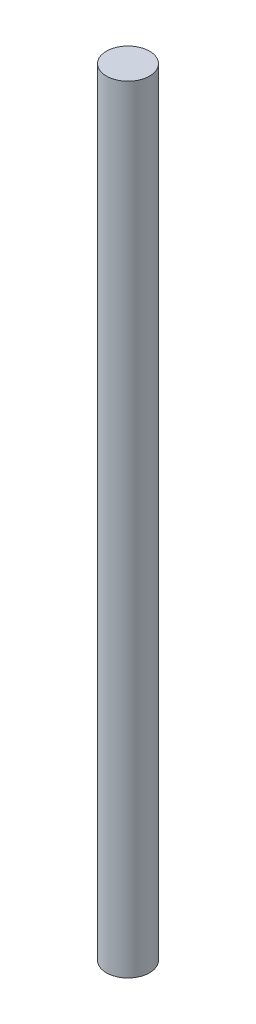
ISO-10303-21;
HEADER;
FILE_DESCRIPTION(('STEP AP214'),'2;1');
FILE_NAME('part.step','',(''),(''),'','','');
FILE_SCHEMA(('AUTOMOTIVE_DESIGN { 1 0 10303 214 1 1 1 1 }'));
ENDSEC;
DATA;
#1=APPLICATION_CONTEXT('core data for automotive mechanical design processes');
#2=APPLICATION_PROTOCOL_DEFINITION('international standard','automotive_design',2000,#1);
#3=PRODUCT_CONTEXT('',#1,'mechanical');
#4=PRODUCT('Part','Part','',(#3));
#5=PRODUCT_RELATED_PRODUCT_CATEGORY('part','',(#4));
#6=PRODUCT_DEFINITION_FORMATION('','',#4);
#7=PRODUCT_DEFINITION_CONTEXT('part definition',#1,'design');
#8=PRODUCT_DEFINITION('design','',#6,#7);
#9=PRODUCT_DEFINITION_SHAPE('','',#8);
#10=(LENGTH_UNIT() NAMED_UNIT(*) SI_UNIT(.MILLI.,.METRE.));
#11=(NAMED_UNIT(*) PLANE_ANGLE_UNIT() SI_UNIT($,.RADIAN.));
#12=(NAMED_UNIT(*) SI_UNIT($,.STERADIAN.) SOLID_ANGLE_UNIT());
#13=UNCERTAINTY_MEASURE_WITH_UNIT(LENGTH_MEASURE(1.E-05),#10,'distance_accuracy_value','');
#14=(GEOMETRIC_REPRESENTATION_CONTEXT(3) GLOBAL_UNCERTAINTY_ASSIGNED_CONTEXT((#13)) GLOBAL_UNIT_ASSIGNED_CONTEXT((#10,
#11,#12)) REPRESENTATION_CONTEXT('',''));
#15=CARTESIAN_POINT('',(0.,0.,0.));
#16=DIRECTION('',(0.,0.,1.));
#17=DIRECTION('',(1.,0.,0.));
#18=AXIS2_PLACEMENT_3D('',#15,#16,#17);
#19=CARTESIAN_POINT('',(0.,228.6,0.));
#20=DIRECTION('',(0.,-1.,0.));
#21=DIRECTION('',(0.,0.,-1.));
#22=AXIS2_PLACEMENT_3D('',#19,#20,#21);
#23=CYLINDRICAL_SURFACE('',#22,6.35);
#24=CARTESIAN_POINT('',(0.,228.6,0.));
#25=DIRECTION('',(0.,1.,0.));
#26=DIRECTION('',(0.,0.,1.));
#27=AXIS2_PLACEMENT_3D('',#24,#25,#26);
#28=CIRCLE('',#27,6.35);
#29=CARTESIAN_POINT('',(0.,228.6,6.35));
#30=VERTEX_POINT('',#29);
#31=EDGE_CURVE('E10',#30,#30,#28,.T.);
#32=ORIENTED_EDGE('',*,*,#31,.F.);
#33=EDGE_LOOP('',(#32));
#34=FACE_BOUND('',#33,.T.);
#35=CARTESIAN_POINT('',(0.,0.,0.));
#36=DIRECTION('',(0.,1.,0.));
#37=DIRECTION('',(0.,0.,1.));
#38=AXIS2_PLACEMENT_3D('',#35,#36,#37);
#39=CIRCLE('',#38,6.35);
#40=CARTESIAN_POINT('',(0.,0.,6.35));
#41=VERTEX_POINT('',#40);
#42=EDGE_CURVE('E34',#41,#41,#39,.T.);
#43=ORIENTED_EDGE('',*,*,#42,.T.);
#44=EDGE_LOOP('',(#43));
#45=FACE_BOUND('',#44,.T.);
#46=ADVANCED_FACE('F31',(#34,#45),#23,.T.);
#47=CARTESIAN_POINT('',(0.,228.6,0.));
#48=DIRECTION('',(0.,1.,0.));
#49=DIRECTION('',(0.,0.,1.));
#50=AXIS2_PLACEMENT_3D('',#47,#48,#49);
#51=PLANE('',#50);
#52=ORIENTED_EDGE('',*,*,#31,.T.);
#53=EDGE_LOOP('',(#52));
#54=FACE_BOUND('',#53,.T.);
#55=ADVANCED_FACE('F46',(#54),#51,.T.);
#56=CARTESIAN_POINT('',(0.,0.,0.));
#57=DIRECTION('',(0.,1.,0.));
#58=DIRECTION('',(0.,0.,1.));
#59=AXIS2_PLACEMENT_3D('',#56,#57,#58);
#60=PLANE('',#59);
#61=ORIENTED_EDGE('',*,*,#42,.F.);
#62=EDGE_LOOP('',(#61));
#63=FACE_BOUND('',#62,.T.);
#64=ADVANCED_FACE('F44',(#63),#60,.F.);
#65=CLOSED_SHELL('',(#46,#55,#64));
#66=MANIFOLD_SOLID_BREP('B2',#65);
#67=ADVANCED_BREP_SHAPE_REPRESENTATION('',(#18,#66),#14);
#68=SHAPE_DEFINITION_REPRESENTATION(#9,#67);
ENDSEC;
END-ISO-10303-21;
